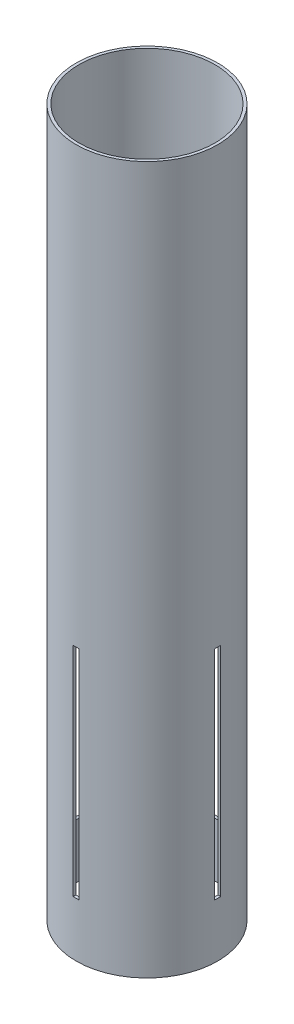
ISO-10303-21;
HEADER;
FILE_DESCRIPTION(('STEP AP214'),'2;1');
FILE_NAME('part.step','',(''),(''),'','','');
FILE_SCHEMA(('AUTOMOTIVE_DESIGN { 1 0 10303 214 1 1 1 1 }'));
ENDSEC;
DATA;
#1=APPLICATION_CONTEXT('core data for automotive mechanical design processes');
#2=APPLICATION_PROTOCOL_DEFINITION('international standard','automotive_design',2000,#1);
#3=PRODUCT_CONTEXT('',#1,'mechanical');
#4=PRODUCT('Part','Part','',(#3));
#5=PRODUCT_RELATED_PRODUCT_CATEGORY('part','',(#4));
#6=PRODUCT_DEFINITION_FORMATION('','',#4);
#7=PRODUCT_DEFINITION_CONTEXT('part definition',#1,'design');
#8=PRODUCT_DEFINITION('design','',#6,#7);
#9=PRODUCT_DEFINITION_SHAPE('','',#8);
#10=(LENGTH_UNIT() NAMED_UNIT(*) SI_UNIT(.MILLI.,.METRE.));
#11=(NAMED_UNIT(*) PLANE_ANGLE_UNIT() SI_UNIT($,.RADIAN.));
#12=(NAMED_UNIT(*) SI_UNIT($,.STERADIAN.) SOLID_ANGLE_UNIT());
#13=UNCERTAINTY_MEASURE_WITH_UNIT(LENGTH_MEASURE(1.E-05),#10,'distance_accuracy_value','');
#14=(GEOMETRIC_REPRESENTATION_CONTEXT(3) GLOBAL_UNCERTAINTY_ASSIGNED_CONTEXT((#13)) GLOBAL_UNIT_ASSIGNED_CONTEXT((#10,
#11,#12)) REPRESENTATION_CONTEXT('',''));
#15=CARTESIAN_POINT('',(0.,0.,0.));
#16=DIRECTION('',(0.,0.,1.));
#17=DIRECTION('',(1.,0.,0.));
#18=AXIS2_PLACEMENT_3D('',#15,#16,#17);
#19=CARTESIAN_POINT('',(0.,198.12,0.));
#20=DIRECTION('',(0.,-1.,0.));
#21=DIRECTION('',(0.,0.,-1.));
#22=AXIS2_PLACEMENT_3D('',#19,#20,#21);
#23=CYLINDRICAL_SURFACE('',#22,39.6748);
#24=CARTESIAN_POINT('',(0.,-45.72,0.));
#25=DIRECTION('',(0.,-1.,0.));
#26=DIRECTION('',(0.,0.,-1.));
#27=AXIS2_PLACEMENT_3D('',#24,#25,#26);
#28=CIRCLE('',#27,39.6748);
#29=CARTESIAN_POINT('',(1.68274999999985,-45.72,39.6390982172589));
#30=VERTEX_POINT('',#29);
#31=CARTESIAN_POINT('',(-1.68275000000014,-45.72,39.6390982172589));
#32=VERTEX_POINT('',#31);
#33=EDGE_CURVE('E63',#30,#32,#28,.T.);
#34=ORIENTED_EDGE('',*,*,#33,.F.);
#35=DIRECTION('',(0.,-1.,0.));
#36=VECTOR('',#35,1.);
#37=CARTESIAN_POINT('',(1.68274999999984,198.12,39.6390982172589));
#38=LINE('',#37,#36);
#39=CARTESIAN_POINT('',(1.68274999999986,-167.64,39.6390982172589));
#40=VERTEX_POINT('',#39);
#41=EDGE_CURVE('E257',#40,#30,#38,.F.);
#42=ORIENTED_EDGE('',*,*,#41,.F.);
#43=CARTESIAN_POINT('',(0.,-167.64,0.));
#44=DIRECTION('',(0.,-1.,0.));
#45=DIRECTION('',(0.,0.,-1.));
#46=AXIS2_PLACEMENT_3D('',#43,#44,#45);
#47=CIRCLE('',#46,39.6748);
#48=CARTESIAN_POINT('',(-1.68275000000013,-167.64,39.6390982172589));
#49=VERTEX_POINT('',#48);
#50=EDGE_CURVE('E259',#40,#49,#47,.T.);
#51=ORIENTED_EDGE('',*,*,#50,.T.);
#52=DIRECTION('',(0.,-1.,0.));
#53=VECTOR('',#52,1.);
#54=CARTESIAN_POINT('',(-1.68275000000015,198.12,39.6390982172589));
#55=LINE('',#54,#53);
#56=EDGE_CURVE('E263',#49,#32,#55,.F.);
#57=ORIENTED_EDGE('',*,*,#56,.T.);
#58=EDGE_LOOP('',(#34,#42,#51,#57));
#59=FACE_BOUND('',#58,.T.);
#60=DIRECTION('',(0.,-1.,0.));
#61=VECTOR('',#60,1.);
#62=CARTESIAN_POINT('',(-39.6390982172589,198.12,1.68275000000001));
#63=LINE('',#62,#61);
#64=CARTESIAN_POINT('',(-39.6390982172589,-45.72,1.68275));
#65=VERTEX_POINT('',#64);
#66=CARTESIAN_POINT('',(-39.6390982172589,-167.64,1.68275000000001));
#67=VERTEX_POINT('',#66);
#68=EDGE_CURVE('E230',#65,#67,#63,.T.);
#69=ORIENTED_EDGE('',*,*,#68,.T.);
#70=CARTESIAN_POINT('',(0.,-167.64,0.));
#71=DIRECTION('',(0.,-1.,0.));
#72=DIRECTION('',(0.,0.,-1.));
#73=AXIS2_PLACEMENT_3D('',#70,#71,#72);
#74=CIRCLE('',#73,39.6748);
#75=CARTESIAN_POINT('',(-39.6390982172589,-167.64,-1.68275));
#76=VERTEX_POINT('',#75);
#77=EDGE_CURVE('E229',#67,#76,#74,.T.);
#78=ORIENTED_EDGE('',*,*,#77,.T.);
#79=DIRECTION('',(0.,-1.,0.));
#80=VECTOR('',#79,1.);
#81=CARTESIAN_POINT('',(-39.6390982172589,198.12,-1.68274999999998));
#82=LINE('',#81,#80);
#83=CARTESIAN_POINT('',(-39.6390982172589,-45.72,-1.68274999999999));
#84=VERTEX_POINT('',#83);
#85=EDGE_CURVE('E222',#84,#76,#82,.T.);
#86=ORIENTED_EDGE('',*,*,#85,.F.);
#87=CARTESIAN_POINT('',(0.,-45.72,0.));
#88=DIRECTION('',(0.,-1.,0.));
#89=DIRECTION('',(0.,0.,-1.));
#90=AXIS2_PLACEMENT_3D('',#87,#88,#89);
#91=CIRCLE('',#90,39.6748);
#92=EDGE_CURVE('E221',#65,#84,#91,.T.);
#93=ORIENTED_EDGE('',*,*,#92,.F.);
#94=EDGE_LOOP('',(#69,#78,#86,#93));
#95=FACE_BOUND('',#94,.T.);
#96=CARTESIAN_POINT('',(0.,198.12,0.));
#97=DIRECTION('',(0.,1.,0.));
#98=DIRECTION('',(0.,0.,1.));
#99=AXIS2_PLACEMENT_3D('',#96,#97,#98);
#100=CIRCLE('',#99,39.6748);
#101=CARTESIAN_POINT('',(0.,198.12,39.6748));
#102=VERTEX_POINT('',#101);
#103=EDGE_CURVE('E207',#102,#102,#100,.T.);
#104=ORIENTED_EDGE('',*,*,#103,.F.);
#105=EDGE_LOOP('',(#104));
#106=FACE_BOUND('',#105,.T.);
#107=CARTESIAN_POINT('',(0.,-198.12,0.));
#108=DIRECTION('',(0.,1.,0.));
#109=DIRECTION('',(0.,0.,1.));
#110=AXIS2_PLACEMENT_3D('',#107,#108,#109);
#111=CIRCLE('',#110,39.6748);
#112=CARTESIAN_POINT('',(0.,-198.12,39.6748));
#113=VERTEX_POINT('',#112);
#114=EDGE_CURVE('E208',#113,#113,#111,.T.);
#115=ORIENTED_EDGE('',*,*,#114,.T.);
#116=EDGE_LOOP('',(#115));
#117=FACE_BOUND('',#116,.T.);
#118=CARTESIAN_POINT('',(39.6390982172589,-45.72,-1.68274999999999));
#119=VERTEX_POINT('',#118);
#120=CARTESIAN_POINT('',(39.6390982172589,-45.72,1.68275));
#121=VERTEX_POINT('',#120);
#122=EDGE_CURVE('E217',#119,#121,#91,.T.);
#123=ORIENTED_EDGE('',*,*,#122,.F.);
#124=DIRECTION('',(0.,-1.,0.));
#125=VECTOR('',#124,1.);
#126=CARTESIAN_POINT('',(39.6390982172589,198.12,-1.68274999999998));
#127=LINE('',#126,#125);
#128=CARTESIAN_POINT('',(39.6390982172589,-167.64,-1.68275));
#129=VERTEX_POINT('',#128);
#130=EDGE_CURVE('E225',#129,#119,#127,.F.);
#131=ORIENTED_EDGE('',*,*,#130,.F.);
#132=CARTESIAN_POINT('',(39.6390982172589,-167.64,1.68274999999999));
#133=VERTEX_POINT('',#132);
#134=EDGE_CURVE('E227',#129,#133,#74,.T.);
#135=ORIENTED_EDGE('',*,*,#134,.T.);
#136=DIRECTION('',(0.,-1.,0.));
#137=VECTOR('',#136,1.);
#138=CARTESIAN_POINT('',(39.6390982172589,198.12,1.68275000000001));
#139=LINE('',#138,#137);
#140=EDGE_CURVE('E233',#133,#121,#139,.F.);
#141=ORIENTED_EDGE('',*,*,#140,.T.);
#142=EDGE_LOOP('',(#123,#131,#135,#141));
#143=FACE_BOUND('',#142,.T.);
#144=CARTESIAN_POINT('',(-1.68274999999986,-45.72,-39.6390982172589));
#145=VERTEX_POINT('',#144);
#146=CARTESIAN_POINT('',(1.68275000000013,-45.72,-39.6390982172589));
#147=VERTEX_POINT('',#146);
#148=EDGE_CURVE('E253',#145,#147,#28,.T.);
#149=ORIENTED_EDGE('',*,*,#148,.F.);
#150=DIRECTION('',(0.,-1.,0.));
#151=VECTOR('',#150,1.);
#152=CARTESIAN_POINT('',(-1.68274999999988,198.12,-39.6390982172589));
#153=LINE('',#152,#151);
#154=CARTESIAN_POINT('',(-1.68274999999985,-167.64,-39.6390982172589));
#155=VERTEX_POINT('',#154);
#156=EDGE_CURVE('E261',#145,#155,#153,.T.);
#157=ORIENTED_EDGE('',*,*,#156,.T.);
#158=CARTESIAN_POINT('',(1.68275000000014,-167.64,-39.6390982172589));
#159=VERTEX_POINT('',#158);
#160=EDGE_CURVE('E166',#155,#159,#47,.T.);
#161=ORIENTED_EDGE('',*,*,#160,.T.);
#162=DIRECTION('',(0.,-1.,0.));
#163=VECTOR('',#162,1.);
#164=CARTESIAN_POINT('',(1.68275000000012,198.12,-39.6390982172589));
#165=LINE('',#164,#163);
#166=EDGE_CURVE('E254',#147,#159,#165,.T.);
#167=ORIENTED_EDGE('',*,*,#166,.F.);
#168=EDGE_LOOP('',(#149,#157,#161,#167));
#169=FACE_BOUND('',#168,.T.);
#170=ADVANCED_FACE('F39',(#59,#95,#106,#117,#143,#169),#23,.T.);
#171=CARTESIAN_POINT('',(0.,198.12,0.));
#172=DIRECTION('',(0.,-1.,0.));
#173=DIRECTION('',(0.,0.,-1.));
#174=AXIS2_PLACEMENT_3D('',#171,#172,#173);
#175=CYLINDRICAL_SURFACE('',#174,38.1);
#176=CARTESIAN_POINT('',(0.,198.12,0.));
#177=DIRECTION('',(0.,1.,0.));
#178=DIRECTION('',(0.,0.,1.));
#179=AXIS2_PLACEMENT_3D('',#176,#177,#178);
#180=CIRCLE('',#179,38.1);
#181=CARTESIAN_POINT('',(0.,198.12,38.1));
#182=VERTEX_POINT('',#181);
#183=EDGE_CURVE('E211',#182,#182,#180,.T.);
#184=ORIENTED_EDGE('',*,*,#183,.T.);
#185=EDGE_LOOP('',(#184));
#186=FACE_BOUND('',#185,.T.);
#187=CARTESIAN_POINT('',(0.,-198.12,0.));
#188=DIRECTION('',(0.,1.,0.));
#189=DIRECTION('',(0.,0.,1.));
#190=AXIS2_PLACEMENT_3D('',#187,#188,#189);
#191=CIRCLE('',#190,38.1);
#192=CARTESIAN_POINT('',(0.,-198.12,38.1));
#193=VERTEX_POINT('',#192);
#194=EDGE_CURVE('E214',#193,#193,#191,.T.);
#195=ORIENTED_EDGE('',*,*,#194,.F.);
#196=EDGE_LOOP('',(#195));
#197=FACE_BOUND('',#196,.T.);
#198=DIRECTION('',(0.,-1.,0.));
#199=VECTOR('',#198,1.);
#200=CARTESIAN_POINT('',(38.0628211308292,198.12,-1.68274999999998));
#201=LINE('',#200,#199);
#202=CARTESIAN_POINT('',(38.0628211308292,-167.64,-1.68275));
#203=VERTEX_POINT('',#202);
#204=CARTESIAN_POINT('',(38.0628211308292,-45.72,-1.68274999999999));
#205=VERTEX_POINT('',#204);
#206=EDGE_CURVE('E199',#203,#205,#201,.F.);
#207=ORIENTED_EDGE('',*,*,#206,.T.);
#208=CARTESIAN_POINT('',(0.,-45.72,0.));
#209=DIRECTION('',(0.,-1.,0.));
#210=DIRECTION('',(0.,0.,-1.));
#211=AXIS2_PLACEMENT_3D('',#208,#209,#210);
#212=CIRCLE('',#211,38.1);
#213=CARTESIAN_POINT('',(38.0628211308292,-45.72,1.68275));
#214=VERTEX_POINT('',#213);
#215=EDGE_CURVE('E191',#205,#214,#212,.T.);
#216=ORIENTED_EDGE('',*,*,#215,.T.);
#217=DIRECTION('',(0.,-1.,0.));
#218=VECTOR('',#217,1.);
#219=CARTESIAN_POINT('',(38.0628211308292,198.12,1.68275000000001));
#220=LINE('',#219,#218);
#221=CARTESIAN_POINT('',(38.0628211308292,-167.64,1.68275000000001));
#222=VERTEX_POINT('',#221);
#223=EDGE_CURVE('E205',#222,#214,#220,.F.);
#224=ORIENTED_EDGE('',*,*,#223,.F.);
#225=CARTESIAN_POINT('',(0.,-167.64,0.));
#226=DIRECTION('',(0.,-1.,0.));
#227=DIRECTION('',(0.,0.,-1.));
#228=AXIS2_PLACEMENT_3D('',#225,#226,#227);
#229=CIRCLE('',#228,38.1);
#230=EDGE_CURVE('E202',#203,#222,#229,.T.);
#231=ORIENTED_EDGE('',*,*,#230,.F.);
#232=EDGE_LOOP('',(#207,#216,#224,#231));
#233=FACE_BOUND('',#232,.T.);
#234=DIRECTION('',(0.,-1.,0.));
#235=VECTOR('',#234,1.);
#236=CARTESIAN_POINT('',(-38.0628211308292,198.12,1.68275000000001));
#237=LINE('',#236,#235);
#238=CARTESIAN_POINT('',(-38.0628211308292,-45.72,1.68275000000001));
#239=VERTEX_POINT('',#238);
#240=CARTESIAN_POINT('',(-38.0628211308292,-167.64,1.68274999999999));
#241=VERTEX_POINT('',#240);
#242=EDGE_CURVE('E196',#239,#241,#237,.T.);
#243=ORIENTED_EDGE('',*,*,#242,.F.);
#244=CARTESIAN_POINT('',(-38.0628211308292,-45.72,-1.68274999999999));
#245=VERTEX_POINT('',#244);
#246=EDGE_CURVE('E186',#239,#245,#212,.T.);
#247=ORIENTED_EDGE('',*,*,#246,.T.);
#248=DIRECTION('',(0.,-1.,0.));
#249=VECTOR('',#248,1.);
#250=CARTESIAN_POINT('',(-38.0628211308292,198.12,-1.68274999999998));
#251=LINE('',#250,#249);
#252=CARTESIAN_POINT('',(-38.0628211308292,-167.64,-1.68275));
#253=VERTEX_POINT('',#252);
#254=EDGE_CURVE('E189',#245,#253,#251,.T.);
#255=ORIENTED_EDGE('',*,*,#254,.T.);
#256=EDGE_CURVE('E195',#241,#253,#229,.T.);
#257=ORIENTED_EDGE('',*,*,#256,.F.);
#258=EDGE_LOOP('',(#243,#247,#255,#257));
#259=FACE_BOUND('',#258,.T.);
#260=DIRECTION('',(0.,-1.,0.));
#261=VECTOR('',#260,1.);
#262=CARTESIAN_POINT('',(1.68274999999985,198.12,38.0628211308292));
#263=LINE('',#262,#261);
#264=CARTESIAN_POINT('',(1.68274999999987,-167.64,38.0628211308292));
#265=VERTEX_POINT('',#264);
#266=CARTESIAN_POINT('',(1.68274999999986,-45.72,38.0628211308292));
#267=VERTEX_POINT('',#266);
#268=EDGE_CURVE('E178',#265,#267,#263,.F.);
#269=ORIENTED_EDGE('',*,*,#268,.T.);
#270=CARTESIAN_POINT('',(0.,-45.72,0.));
#271=DIRECTION('',(0.,-1.,0.));
#272=DIRECTION('',(0.,0.,-1.));
#273=AXIS2_PLACEMENT_3D('',#270,#271,#272);
#274=CIRCLE('',#273,38.1);
#275=CARTESIAN_POINT('',(-1.68275000000013,-45.72,38.0628211308292));
#276=VERTEX_POINT('',#275);
#277=EDGE_CURVE('E48',#267,#276,#274,.T.);
#278=ORIENTED_EDGE('',*,*,#277,.T.);
#279=DIRECTION('',(0.,-1.,0.));
#280=VECTOR('',#279,1.);
#281=CARTESIAN_POINT('',(-1.68275000000015,198.12,38.0628211308292));
#282=LINE('',#281,#280);
#283=CARTESIAN_POINT('',(-1.68275000000015,-167.64,38.0628211308292));
#284=VERTEX_POINT('',#283);
#285=EDGE_CURVE('E179',#284,#276,#282,.F.);
#286=ORIENTED_EDGE('',*,*,#285,.F.);
#287=CARTESIAN_POINT('',(0.,-167.64,0.));
#288=DIRECTION('',(0.,-1.,0.));
#289=DIRECTION('',(0.,0.,-1.));
#290=AXIS2_PLACEMENT_3D('',#287,#288,#289);
#291=CIRCLE('',#290,38.1);
#292=EDGE_CURVE('E174',#265,#284,#291,.T.);
#293=ORIENTED_EDGE('',*,*,#292,.F.);
#294=EDGE_LOOP('',(#269,#278,#286,#293));
#295=FACE_BOUND('',#294,.T.);
#296=DIRECTION('',(0.,-1.,0.));
#297=VECTOR('',#296,1.);
#298=CARTESIAN_POINT('',(-1.68274999999988,198.12,-38.0628211308292));
#299=LINE('',#298,#297);
#300=CARTESIAN_POINT('',(-1.68274999999988,-45.72,-38.0628211308292));
#301=VERTEX_POINT('',#300);
#302=CARTESIAN_POINT('',(-1.68274999999986,-167.64,-38.0628211308292));
#303=VERTEX_POINT('',#302);
#304=EDGE_CURVE('E154',#301,#303,#299,.T.);
#305=ORIENTED_EDGE('',*,*,#304,.F.);
#306=CARTESIAN_POINT('',(1.68275000000013,-45.72,-38.0628211308292));
#307=VERTEX_POINT('',#306);
#308=EDGE_CURVE('E11',#301,#307,#274,.T.);
#309=ORIENTED_EDGE('',*,*,#308,.T.);
#310=DIRECTION('',(0.,-1.,0.));
#311=VECTOR('',#310,1.);
#312=CARTESIAN_POINT('',(1.68275000000011,198.12,-38.0628211308292));
#313=LINE('',#312,#311);
#314=CARTESIAN_POINT('',(1.68275000000013,-167.64,-38.0628211308292));
#315=VERTEX_POINT('',#314);
#316=EDGE_CURVE('E42',#307,#315,#313,.T.);
#317=ORIENTED_EDGE('',*,*,#316,.T.);
#318=EDGE_CURVE('E161',#303,#315,#291,.T.);
#319=ORIENTED_EDGE('',*,*,#318,.F.);
#320=EDGE_LOOP('',(#305,#309,#317,#319));
#321=FACE_BOUND('',#320,.T.);
#322=ADVANCED_FACE('F172',(#186,#197,#233,#259,#295,#321),#175,.F.);
#323=CARTESIAN_POINT('',(0.,198.12,0.));
#324=DIRECTION('',(0.,1.,0.));
#325=DIRECTION('',(0.,0.,1.));
#326=AXIS2_PLACEMENT_3D('',#323,#324,#325);
#327=PLANE('',#326);
#328=ORIENTED_EDGE('',*,*,#103,.T.);
#329=EDGE_LOOP('',(#328));
#330=FACE_BOUND('',#329,.T.);
#331=ORIENTED_EDGE('',*,*,#183,.F.);
#332=EDGE_LOOP('',(#331));
#333=FACE_BOUND('',#332,.T.);
#334=ADVANCED_FACE('F300',(#330,#333),#327,.T.);
#335=CARTESIAN_POINT('',(0.,-198.12,0.));
#336=DIRECTION('',(0.,1.,0.));
#337=DIRECTION('',(0.,0.,1.));
#338=AXIS2_PLACEMENT_3D('',#335,#336,#337);
#339=PLANE('',#338);
#340=ORIENTED_EDGE('',*,*,#114,.F.);
#341=EDGE_LOOP('',(#340));
#342=FACE_BOUND('',#341,.T.);
#343=ORIENTED_EDGE('',*,*,#194,.T.);
#344=EDGE_LOOP('',(#343));
#345=FACE_BOUND('',#344,.T.);
#346=ADVANCED_FACE('F306',(#342,#345),#339,.F.);
#347=CARTESIAN_POINT('',(-39.6748,-45.72,1.68275));
#348=DIRECTION('',(0.,0.,1.));
#349=DIRECTION('',(0.,-1.,0.));
#350=AXIS2_PLACEMENT_3D('',#347,#348,#349);
#351=PLANE('',#350);
#352=DIRECTION('',(1.,0.,0.));
#353=VECTOR('',#352,1.);
#354=CARTESIAN_POINT('',(-39.6748,-167.64,1.68274999999999));
#355=LINE('',#354,#353);
#356=EDGE_CURVE('E245',#222,#133,#355,.T.);
#357=ORIENTED_EDGE('',*,*,#356,.F.);
#358=ORIENTED_EDGE('',*,*,#223,.T.);
#359=DIRECTION('',(1.,0.,0.));
#360=VECTOR('',#359,1.);
#361=CARTESIAN_POINT('',(-39.6748,-45.72,1.68275));
#362=LINE('',#361,#360);
#363=EDGE_CURVE('E249',#214,#121,#362,.T.);
#364=ORIENTED_EDGE('',*,*,#363,.T.);
#365=ORIENTED_EDGE('',*,*,#140,.F.);
#366=EDGE_LOOP('',(#357,#358,#364,#365));
#367=FACE_BOUND('',#366,.T.);
#368=ADVANCED_FACE('F314',(#367),#351,.F.);
#369=CARTESIAN_POINT('',(-39.6748,-167.64,1.68274999999999));
#370=DIRECTION('',(0.,-1.,0.));
#371=DIRECTION('',(0.,0.,-1.));
#372=AXIS2_PLACEMENT_3D('',#369,#370,#371);
#373=PLANE('',#372);
#374=DIRECTION('',(1.,0.,0.));
#375=VECTOR('',#374,1.);
#376=CARTESIAN_POINT('',(-39.6748,-167.64,-1.68275));
#377=LINE('',#376,#375);
#378=EDGE_CURVE('E241',#203,#129,#377,.T.);
#379=ORIENTED_EDGE('',*,*,#378,.F.);
#380=ORIENTED_EDGE('',*,*,#230,.T.);
#381=ORIENTED_EDGE('',*,*,#356,.T.);
#382=ORIENTED_EDGE('',*,*,#134,.F.);
#383=EDGE_LOOP('',(#379,#380,#381,#382));
#384=FACE_BOUND('',#383,.T.);
#385=ADVANCED_FACE('F319',(#384),#373,.F.);
#386=CARTESIAN_POINT('',(-39.6748,-45.72,-1.68274999999999));
#387=DIRECTION('',(0.,0.,1.));
#388=DIRECTION('',(0.,-1.,0.));
#389=AXIS2_PLACEMENT_3D('',#386,#387,#388);
#390=PLANE('',#389);
#391=ORIENTED_EDGE('',*,*,#130,.T.);
#392=DIRECTION('',(1.,0.,0.));
#393=VECTOR('',#392,1.);
#394=CARTESIAN_POINT('',(-39.6748,-45.72,-1.68274999999999));
#395=LINE('',#394,#393);
#396=EDGE_CURVE('E237',#205,#119,#395,.T.);
#397=ORIENTED_EDGE('',*,*,#396,.F.);
#398=ORIENTED_EDGE('',*,*,#206,.F.);
#399=ORIENTED_EDGE('',*,*,#378,.T.);
#400=EDGE_LOOP('',(#391,#397,#398,#399));
#401=FACE_BOUND('',#400,.T.);
#402=ADVANCED_FACE('F349',(#401),#390,.T.);
#403=CARTESIAN_POINT('',(-39.6748,-45.72,1.68275));
#404=DIRECTION('',(0.,-1.,0.));
#405=DIRECTION('',(0.,0.,-1.));
#406=AXIS2_PLACEMENT_3D('',#403,#404,#405);
#407=PLANE('',#406);
#408=ORIENTED_EDGE('',*,*,#122,.T.);
#409=ORIENTED_EDGE('',*,*,#363,.F.);
#410=ORIENTED_EDGE('',*,*,#215,.F.);
#411=ORIENTED_EDGE('',*,*,#396,.T.);
#412=EDGE_LOOP('',(#408,#409,#410,#411));
#413=FACE_BOUND('',#412,.T.);
#414=ADVANCED_FACE('F311',(#413),#407,.T.);
#415=ORIENTED_EDGE('',*,*,#92,.T.);
#416=EDGE_CURVE('E236',#84,#245,#395,.T.);
#417=ORIENTED_EDGE('',*,*,#416,.T.);
#418=ORIENTED_EDGE('',*,*,#246,.F.);
#419=EDGE_CURVE('E248',#65,#239,#362,.T.);
#420=ORIENTED_EDGE('',*,*,#419,.F.);
#421=EDGE_LOOP('',(#415,#417,#418,#420));
#422=FACE_BOUND('',#421,.T.);
#423=ADVANCED_FACE('F343',(#422),#407,.T.);
#424=ORIENTED_EDGE('',*,*,#85,.T.);
#425=EDGE_CURVE('E240',#76,#253,#377,.T.);
#426=ORIENTED_EDGE('',*,*,#425,.T.);
#427=ORIENTED_EDGE('',*,*,#254,.F.);
#428=ORIENTED_EDGE('',*,*,#416,.F.);
#429=EDGE_LOOP('',(#424,#426,#427,#428));
#430=FACE_BOUND('',#429,.T.);
#431=ADVANCED_FACE('F347',(#430),#390,.T.);
#432=EDGE_CURVE('E244',#67,#241,#355,.T.);
#433=ORIENTED_EDGE('',*,*,#432,.T.);
#434=ORIENTED_EDGE('',*,*,#256,.T.);
#435=ORIENTED_EDGE('',*,*,#425,.F.);
#436=ORIENTED_EDGE('',*,*,#77,.F.);
#437=EDGE_LOOP('',(#433,#434,#435,#436));
#438=FACE_BOUND('',#437,.T.);
#439=ADVANCED_FACE('F336',(#438),#373,.F.);
#440=ORIENTED_EDGE('',*,*,#419,.T.);
#441=ORIENTED_EDGE('',*,*,#242,.T.);
#442=ORIENTED_EDGE('',*,*,#432,.F.);
#443=ORIENTED_EDGE('',*,*,#68,.F.);
#444=EDGE_LOOP('',(#440,#441,#442,#443));
#445=FACE_BOUND('',#444,.T.);
#446=ADVANCED_FACE('F321',(#445),#351,.F.);
#447=CARTESIAN_POINT('',(-1.68274999999986,-45.72,-39.6748000000001));
#448=DIRECTION('',(-1.,0.,0.));
#449=DIRECTION('',(0.,0.,1.));
#450=AXIS2_PLACEMENT_3D('',#447,#448,#449);
#451=PLANE('',#450);
#452=DIRECTION('',(0.,0.,1.));
#453=VECTOR('',#452,1.);
#454=CARTESIAN_POINT('',(-1.68274999999985,-167.64,-39.6748000000001));
#455=LINE('',#454,#453);
#456=EDGE_CURVE('E169',#284,#49,#455,.T.);
#457=ORIENTED_EDGE('',*,*,#456,.F.);
#458=ORIENTED_EDGE('',*,*,#285,.T.);
#459=DIRECTION('',(0.,0.,1.));
#460=VECTOR('',#459,1.);
#461=CARTESIAN_POINT('',(-1.68274999999986,-45.72,-39.6748000000001));
#462=LINE('',#461,#460);
#463=EDGE_CURVE('E272',#276,#32,#462,.T.);
#464=ORIENTED_EDGE('',*,*,#463,.T.);
#465=ORIENTED_EDGE('',*,*,#56,.F.);
#466=EDGE_LOOP('',(#457,#458,#464,#465));
#467=FACE_BOUND('',#466,.T.);
#468=ADVANCED_FACE('F274',(#467),#451,.F.);
#469=CARTESIAN_POINT('',(-1.68274999999985,-167.64,-39.6748000000001));
#470=DIRECTION('',(0.,-1.,0.));
#471=DIRECTION('',(0.,0.,-1.));
#472=AXIS2_PLACEMENT_3D('',#469,#470,#471);
#473=PLANE('',#472);
#474=DIRECTION('',(0.,0.,1.));
#475=VECTOR('',#474,1.);
#476=CARTESIAN_POINT('',(1.68275000000014,-167.64,-39.6748000000001));
#477=LINE('',#476,#475);
#478=EDGE_CURVE('E168',#265,#40,#477,.T.);
#479=ORIENTED_EDGE('',*,*,#478,.F.);
#480=ORIENTED_EDGE('',*,*,#292,.T.);
#481=ORIENTED_EDGE('',*,*,#456,.T.);
#482=ORIENTED_EDGE('',*,*,#50,.F.);
#483=EDGE_LOOP('',(#479,#480,#481,#482));
#484=FACE_BOUND('',#483,.T.);
#485=ADVANCED_FACE('F279',(#484),#473,.F.);
#486=CARTESIAN_POINT('',(1.68275000000013,-45.72,-39.6748000000001));
#487=DIRECTION('',(-1.,0.,0.));
#488=DIRECTION('',(0.,0.,1.));
#489=AXIS2_PLACEMENT_3D('',#486,#487,#488);
#490=PLANE('',#489);
#491=ORIENTED_EDGE('',*,*,#41,.T.);
#492=DIRECTION('',(0.,0.,1.));
#493=VECTOR('',#492,1.);
#494=CARTESIAN_POINT('',(1.68275000000013,-45.72,-39.6748000000001));
#495=LINE('',#494,#493);
#496=EDGE_CURVE('E267',#267,#30,#495,.T.);
#497=ORIENTED_EDGE('',*,*,#496,.F.);
#498=ORIENTED_EDGE('',*,*,#268,.F.);
#499=ORIENTED_EDGE('',*,*,#478,.T.);
#500=EDGE_LOOP('',(#491,#497,#498,#499));
#501=FACE_BOUND('',#500,.T.);
#502=ADVANCED_FACE('F281',(#501),#490,.T.);
#503=CARTESIAN_POINT('',(-1.68274999999986,-45.72,-39.6748000000001));
#504=DIRECTION('',(0.,-1.,0.));
#505=DIRECTION('',(0.,0.,-1.));
#506=AXIS2_PLACEMENT_3D('',#503,#504,#505);
#507=PLANE('',#506);
#508=ORIENTED_EDGE('',*,*,#33,.T.);
#509=ORIENTED_EDGE('',*,*,#463,.F.);
#510=ORIENTED_EDGE('',*,*,#277,.F.);
#511=ORIENTED_EDGE('',*,*,#496,.T.);
#512=EDGE_LOOP('',(#508,#509,#510,#511));
#513=FACE_BOUND('',#512,.T.);
#514=ADVANCED_FACE('F284',(#513),#507,.T.);
#515=ORIENTED_EDGE('',*,*,#148,.T.);
#516=EDGE_CURVE('E266',#147,#307,#495,.T.);
#517=ORIENTED_EDGE('',*,*,#516,.T.);
#518=ORIENTED_EDGE('',*,*,#308,.F.);
#519=EDGE_CURVE('E157',#145,#301,#462,.T.);
#520=ORIENTED_EDGE('',*,*,#519,.F.);
#521=EDGE_LOOP('',(#515,#517,#518,#520));
#522=FACE_BOUND('',#521,.T.);
#523=ADVANCED_FACE('F286',(#522),#507,.T.);
#524=ORIENTED_EDGE('',*,*,#166,.T.);
#525=EDGE_CURVE('E269',#159,#315,#477,.T.);
#526=ORIENTED_EDGE('',*,*,#525,.T.);
#527=ORIENTED_EDGE('',*,*,#316,.F.);
#528=ORIENTED_EDGE('',*,*,#516,.F.);
#529=EDGE_LOOP('',(#524,#526,#527,#528));
#530=FACE_BOUND('',#529,.T.);
#531=ADVANCED_FACE('F292',(#530),#490,.T.);
#532=ORIENTED_EDGE('',*,*,#160,.F.);
#533=EDGE_CURVE('E55',#155,#303,#455,.T.);
#534=ORIENTED_EDGE('',*,*,#533,.T.);
#535=ORIENTED_EDGE('',*,*,#318,.T.);
#536=ORIENTED_EDGE('',*,*,#525,.F.);
#537=EDGE_LOOP('',(#532,#534,#535,#536));
#538=FACE_BOUND('',#537,.T.);
#539=ADVANCED_FACE('F163',(#538),#473,.F.);
#540=ORIENTED_EDGE('',*,*,#519,.T.);
#541=ORIENTED_EDGE('',*,*,#304,.T.);
#542=ORIENTED_EDGE('',*,*,#533,.F.);
#543=ORIENTED_EDGE('',*,*,#156,.F.);
#544=EDGE_LOOP('',(#540,#541,#542,#543));
#545=FACE_BOUND('',#544,.T.);
#546=ADVANCED_FACE('F155',(#545),#451,.F.);
#547=CLOSED_SHELL('',(#170,#322,#334,#346,#368,#385,#402,#414,#423,#431,#439,#446,#468,#485,
#502,#514,#523,#531,#539,#546));
#548=MANIFOLD_SOLID_BREP('B2',#547);
#549=ADVANCED_BREP_SHAPE_REPRESENTATION('',(#18,#548),#14);
#550=SHAPE_DEFINITION_REPRESENTATION(#9,#549);
ENDSEC;
END-ISO-10303-21;
